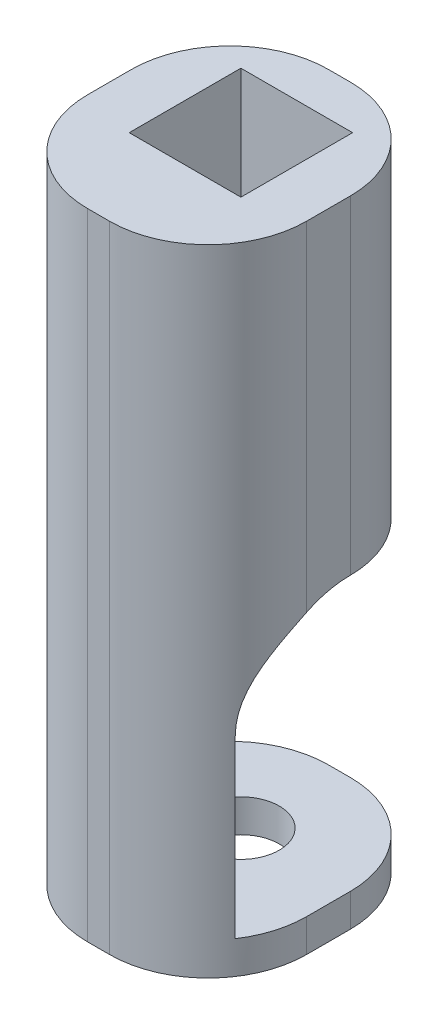
ISO-10303-21;
HEADER;
FILE_DESCRIPTION(('STEP AP214'),'2;1');
FILE_NAME('part.step','',(''),(''),'','','');
FILE_SCHEMA(('AUTOMOTIVE_DESIGN { 1 0 10303 214 1 1 1 1 }'));
ENDSEC;
DATA;
#1=APPLICATION_CONTEXT('core data for automotive mechanical design processes');
#2=APPLICATION_PROTOCOL_DEFINITION('international standard','automotive_design',2000,#1);
#3=PRODUCT_CONTEXT('',#1,'mechanical');
#4=PRODUCT('Part','Part','',(#3));
#5=PRODUCT_RELATED_PRODUCT_CATEGORY('part','',(#4));
#6=PRODUCT_DEFINITION_FORMATION('','',#4);
#7=PRODUCT_DEFINITION_CONTEXT('part definition',#1,'design');
#8=PRODUCT_DEFINITION('design','',#6,#7);
#9=PRODUCT_DEFINITION_SHAPE('','',#8);
#10=(LENGTH_UNIT() NAMED_UNIT(*) SI_UNIT(.MILLI.,.METRE.));
#11=(NAMED_UNIT(*) PLANE_ANGLE_UNIT() SI_UNIT($,.RADIAN.));
#12=(NAMED_UNIT(*) SI_UNIT($,.STERADIAN.) SOLID_ANGLE_UNIT());
#13=UNCERTAINTY_MEASURE_WITH_UNIT(LENGTH_MEASURE(1.E-05),#10,'distance_accuracy_value','');
#14=(GEOMETRIC_REPRESENTATION_CONTEXT(3) GLOBAL_UNCERTAINTY_ASSIGNED_CONTEXT((#13)) GLOBAL_UNIT_ASSIGNED_CONTEXT((#10,
#11,#12)) REPRESENTATION_CONTEXT('',''));
#15=CARTESIAN_POINT('',(0.,0.,0.));
#16=DIRECTION('',(0.,0.,1.));
#17=DIRECTION('',(1.,0.,0.));
#18=AXIS2_PLACEMENT_3D('',#15,#16,#17);
#19=CARTESIAN_POINT('',(-10.,3.,11.));
#20=DIRECTION('',(1.,0.,0.));
#21=DIRECTION('',(0.,0.,-1.));
#22=AXIS2_PLACEMENT_3D('',#19,#20,#21);
#23=PLANE('',#22);
#24=DIRECTION('',(0.,0.,1.));
#25=VECTOR('',#24,1.);
#26=CARTESIAN_POINT('',(-10.,0.,11.));
#27=LINE('',#26,#25);
#28=CARTESIAN_POINT('',(-10.,0.,-2.));
#29=VERTEX_POINT('',#28);
#30=CARTESIAN_POINT('',(-10.,0.,2.));
#31=VERTEX_POINT('',#30);
#32=EDGE_CURVE('E379',#29,#31,#27,.T.);
#33=ORIENTED_EDGE('',*,*,#32,.T.);
#34=DIRECTION('',(0.,-1.,0.));
#35=VECTOR('',#34,1.);
#36=CARTESIAN_POINT('',(-10.,3.,2.));
#37=LINE('',#36,#35);
#38=CARTESIAN_POINT('',(-10.,3.,2.));
#39=VERTEX_POINT('',#38);
#40=EDGE_CURVE('E296',#31,#39,#37,.F.);
#41=ORIENTED_EDGE('',*,*,#40,.T.);
#42=DIRECTION('',(0.,0.,1.));
#43=VECTOR('',#42,1.);
#44=CARTESIAN_POINT('',(-10.,3.,11.));
#45=LINE('',#44,#43);
#46=CARTESIAN_POINT('',(-10.,3.,-2.));
#47=VERTEX_POINT('',#46);
#48=EDGE_CURVE('E375',#47,#39,#45,.T.);
#49=ORIENTED_EDGE('',*,*,#48,.F.);
#50=DIRECTION('',(0.,-1.,0.));
#51=VECTOR('',#50,1.);
#52=CARTESIAN_POINT('',(-10.,3.,-2.));
#53=LINE('',#52,#51);
#54=EDGE_CURVE('E372',#47,#29,#53,.T.);
#55=ORIENTED_EDGE('',*,*,#54,.T.);
#56=EDGE_LOOP('',(#33,#41,#49,#55));
#57=FACE_BOUND('',#56,.T.);
#58=ADVANCED_FACE('F35',(#57),#23,.F.);
#59=CARTESIAN_POINT('',(10.,3.,11.));
#60=DIRECTION('',(-1.,0.,0.));
#61=DIRECTION('',(0.,0.,1.));
#62=AXIS2_PLACEMENT_3D('',#59,#60,#61);
#63=PLANE('',#62);
#64=DIRECTION('',(0.,0.,-1.));
#65=VECTOR('',#64,1.);
#66=CARTESIAN_POINT('',(10.,58.,-11.));
#67=LINE('',#66,#65);
#68=CARTESIAN_POINT('',(10.,58.,1.99999999999999));
#69=VERTEX_POINT('',#68);
#70=CARTESIAN_POINT('',(10.,58.,-2.));
#71=VERTEX_POINT('',#70);
#72=EDGE_CURVE('E319',#69,#71,#67,.T.);
#73=ORIENTED_EDGE('',*,*,#72,.F.);
#74=DIRECTION('',(0.,-1.,0.));
#75=VECTOR('',#74,1.);
#76=CARTESIAN_POINT('',(10.,3.,1.99999999999999));
#77=LINE('',#76,#75);
#78=CARTESIAN_POINT('',(10.,27.0622577482986,1.99999999999999));
#79=VERTEX_POINT('',#78);
#80=EDGE_CURVE('E61',#69,#79,#77,.T.);
#81=ORIENTED_EDGE('',*,*,#80,.T.);
#82=CARTESIAN_POINT('',(10.,19.,-2.));
#83=DIRECTION('',(-1.,0.,0.));
#84=DIRECTION('',(0.,0.,1.));
#85=AXIS2_PLACEMENT_3D('',#82,#83,#84);
#86=CIRCLE('',#85,9.);
#87=CARTESIAN_POINT('',(10.,28.,-2.));
#88=VERTEX_POINT('',#87);
#89=EDGE_CURVE('E48',#79,#88,#86,.T.);
#90=ORIENTED_EDGE('',*,*,#89,.T.);
#91=DIRECTION('',(0.,-1.,0.));
#92=VECTOR('',#91,1.);
#93=CARTESIAN_POINT('',(10.,3.,-2.));
#94=LINE('',#93,#92);
#95=EDGE_CURVE('E361',#88,#71,#94,.F.);
#96=ORIENTED_EDGE('',*,*,#95,.T.);
#97=EDGE_LOOP('',(#73,#81,#90,#96));
#98=FACE_BOUND('',#97,.T.);
#99=ADVANCED_FACE('F263',(#98),#63,.F.);
#100=CARTESIAN_POINT('',(1.,3.,-2.));
#101=DIRECTION('',(0.,1.,0.));
#102=DIRECTION('',(0.,0.,1.));
#103=AXIS2_PLACEMENT_3D('',#100,#101,#102);
#104=PLANE('',#103);
#105=DIRECTION('',(-1.,0.,0.));
#106=VECTOR('',#105,1.);
#107=CARTESIAN_POINT('',(10.,3.,7.));
#108=LINE('',#107,#106);
#109=CARTESIAN_POINT('',(8.48331477354788,3.,7.));
#110=VERTEX_POINT('',#109);
#111=CARTESIAN_POINT('',(-8.48331477354788,3.,7.));
#112=VERTEX_POINT('',#111);
#113=EDGE_CURVE('E336',#110,#112,#108,.T.);
#114=ORIENTED_EDGE('',*,*,#113,.F.);
#115=CARTESIAN_POINT('',(1.,3.,2.));
#116=DIRECTION('',(0.,1.,0.));
#117=DIRECTION('',(0.,0.,1.));
#118=AXIS2_PLACEMENT_3D('',#115,#116,#117);
#119=CIRCLE('',#118,9.);
#120=CARTESIAN_POINT('',(10.,3.,1.99999999999999));
#121=VERTEX_POINT('',#120);
#122=EDGE_CURVE('E345',#110,#121,#119,.T.);
#123=ORIENTED_EDGE('',*,*,#122,.T.);
#124=DIRECTION('',(0.,0.,-1.));
#125=VECTOR('',#124,1.);
#126=CARTESIAN_POINT('',(10.,3.,11.));
#127=LINE('',#126,#125);
#128=CARTESIAN_POINT('',(10.,3.,-2.));
#129=VERTEX_POINT('',#128);
#130=EDGE_CURVE('E378',#121,#129,#127,.T.);
#131=ORIENTED_EDGE('',*,*,#130,.T.);
#132=CARTESIAN_POINT('',(1.,3.,-2.));
#133=DIRECTION('',(0.,1.,0.));
#134=DIRECTION('',(0.,0.,1.));
#135=AXIS2_PLACEMENT_3D('',#132,#133,#134);
#136=CIRCLE('',#135,9.);
#137=CARTESIAN_POINT('',(1.,3.,-11.));
#138=VERTEX_POINT('',#137);
#139=EDGE_CURVE('E396',#129,#138,#136,.T.);
#140=ORIENTED_EDGE('',*,*,#139,.T.);
#141=DIRECTION('',(-1.,0.,0.));
#142=VECTOR('',#141,1.);
#143=CARTESIAN_POINT('',(1.,3.,-11.));
#144=LINE('',#143,#142);
#145=CARTESIAN_POINT('',(-1.,3.,-11.));
#146=VERTEX_POINT('',#145);
#147=EDGE_CURVE('E394',#138,#146,#144,.T.);
#148=ORIENTED_EDGE('',*,*,#147,.T.);
#149=CARTESIAN_POINT('',(-1.,3.,-2.));
#150=DIRECTION('',(0.,1.,0.));
#151=DIRECTION('',(0.,0.,1.));
#152=AXIS2_PLACEMENT_3D('',#149,#150,#151);
#153=CIRCLE('',#152,9.);
#154=EDGE_CURVE('E392',#146,#47,#153,.T.);
#155=ORIENTED_EDGE('',*,*,#154,.T.);
#156=ORIENTED_EDGE('',*,*,#48,.T.);
#157=CARTESIAN_POINT('',(-1.,3.,2.));
#158=DIRECTION('',(0.,1.,0.));
#159=DIRECTION('',(0.,0.,1.));
#160=AXIS2_PLACEMENT_3D('',#157,#158,#159);
#161=CIRCLE('',#160,9.);
#162=EDGE_CURVE('E347',#39,#112,#161,.T.);
#163=ORIENTED_EDGE('',*,*,#162,.T.);
#164=EDGE_LOOP('',(#114,#123,#131,#140,#148,#155,#156,#163));
#165=FACE_BOUND('',#164,.T.);
#166=CARTESIAN_POINT('',(0.,3.,-2.));
#167=DIRECTION('',(0.,1.,0.));
#168=DIRECTION('',(0.,0.,1.));
#169=AXIS2_PLACEMENT_3D('',#166,#167,#168);
#170=CIRCLE('',#169,3.5);
#171=CARTESIAN_POINT('',(0.,3.,1.5));
#172=VERTEX_POINT('',#171);
#173=EDGE_CURVE('E389',#172,#172,#170,.T.);
#174=ORIENTED_EDGE('',*,*,#173,.F.);
#175=EDGE_LOOP('',(#174));
#176=FACE_BOUND('',#175,.T.);
#177=DIRECTION('',(-1.,0.,0.));
#178=VECTOR('',#177,1.);
#179=CARTESIAN_POINT('',(-8.5,3.,-3.5));
#180=LINE('',#179,#178);
#181=CARTESIAN_POINT('',(-6.5,3.,-3.5));
#182=VERTEX_POINT('',#181);
#183=CARTESIAN_POINT('',(-8.5,3.,-3.5));
#184=VERTEX_POINT('',#183);
#185=EDGE_CURVE('E432',#182,#184,#180,.T.);
#186=ORIENTED_EDGE('',*,*,#185,.F.);
#187=DIRECTION('',(0.,0.,-1.));
#188=VECTOR('',#187,1.);
#189=CARTESIAN_POINT('',(-6.5,3.,-0.499999999999999));
#190=LINE('',#189,#188);
#191=CARTESIAN_POINT('',(-6.5,3.,-0.499999999999999));
#192=VERTEX_POINT('',#191);
#193=EDGE_CURVE('E418',#192,#182,#190,.T.);
#194=ORIENTED_EDGE('',*,*,#193,.F.);
#195=DIRECTION('',(1.,0.,0.));
#196=VECTOR('',#195,1.);
#197=CARTESIAN_POINT('',(-8.5,3.,-0.499999999999999));
#198=LINE('',#197,#196);
#199=CARTESIAN_POINT('',(-8.5,3.,-0.499999999999999));
#200=VERTEX_POINT('',#199);
#201=EDGE_CURVE('E414',#200,#192,#198,.T.);
#202=ORIENTED_EDGE('',*,*,#201,.F.);
#203=DIRECTION('',(0.,0.,1.));
#204=VECTOR('',#203,1.);
#205=CARTESIAN_POINT('',(-8.5,3.,-0.499999999999999));
#206=LINE('',#205,#204);
#207=EDGE_CURVE('E429',#184,#200,#206,.T.);
#208=ORIENTED_EDGE('',*,*,#207,.F.);
#209=EDGE_LOOP('',(#186,#194,#202,#208));
#210=FACE_BOUND('',#209,.T.);
#211=ADVANCED_FACE('F270',(#165,#176,#210),#104,.T.);
#212=CARTESIAN_POINT('',(1.,0.,-2.));
#213=DIRECTION('',(0.,1.,0.));
#214=DIRECTION('',(0.,0.,1.));
#215=AXIS2_PLACEMENT_3D('',#212,#213,#214);
#216=PLANE('',#215);
#217=CARTESIAN_POINT('',(0.,0.,-2.));
#218=DIRECTION('',(0.,1.,0.));
#219=DIRECTION('',(0.,0.,1.));
#220=AXIS2_PLACEMENT_3D('',#217,#218,#219);
#221=CIRCLE('',#220,3.5);
#222=CARTESIAN_POINT('',(0.,0.,1.5));
#223=VERTEX_POINT('',#222);
#224=EDGE_CURVE('E399',#223,#223,#221,.T.);
#225=ORIENTED_EDGE('',*,*,#224,.T.);
#226=EDGE_LOOP('',(#225));
#227=FACE_BOUND('',#226,.T.);
#228=DIRECTION('',(0.,0.,-1.));
#229=VECTOR('',#228,1.);
#230=CARTESIAN_POINT('',(10.,0.,11.));
#231=LINE('',#230,#229);
#232=CARTESIAN_POINT('',(10.,0.,1.99999999999999));
#233=VERTEX_POINT('',#232);
#234=CARTESIAN_POINT('',(10.,0.,-2.));
#235=VERTEX_POINT('',#234);
#236=EDGE_CURVE('E387',#233,#235,#231,.T.);
#237=ORIENTED_EDGE('',*,*,#236,.F.);
#238=CARTESIAN_POINT('',(1.,0.,2.));
#239=DIRECTION('',(0.,1.,0.));
#240=DIRECTION('',(0.,0.,1.));
#241=AXIS2_PLACEMENT_3D('',#238,#239,#240);
#242=CIRCLE('',#241,9.);
#243=CARTESIAN_POINT('',(1.,0.,11.));
#244=VERTEX_POINT('',#243);
#245=EDGE_CURVE('E341',#233,#244,#242,.F.);
#246=ORIENTED_EDGE('',*,*,#245,.T.);
#247=DIRECTION('',(1.,0.,0.));
#248=VECTOR('',#247,1.);
#249=CARTESIAN_POINT('',(10.,0.,11.));
#250=LINE('',#249,#248);
#251=CARTESIAN_POINT('',(-1.,0.,11.));
#252=VERTEX_POINT('',#251);
#253=EDGE_CURVE('E376',#252,#244,#250,.T.);
#254=ORIENTED_EDGE('',*,*,#253,.F.);
#255=CARTESIAN_POINT('',(-1.,0.,2.));
#256=DIRECTION('',(0.,1.,0.));
#257=DIRECTION('',(0.,0.,1.));
#258=AXIS2_PLACEMENT_3D('',#255,#256,#257);
#259=CIRCLE('',#258,9.);
#260=EDGE_CURVE('E340',#252,#31,#259,.F.);
#261=ORIENTED_EDGE('',*,*,#260,.T.);
#262=ORIENTED_EDGE('',*,*,#32,.F.);
#263=CARTESIAN_POINT('',(-1.,0.,-2.));
#264=DIRECTION('',(0.,1.,0.));
#265=DIRECTION('',(0.,0.,1.));
#266=AXIS2_PLACEMENT_3D('',#263,#264,#265);
#267=CIRCLE('',#266,9.);
#268=CARTESIAN_POINT('',(-1.,0.,-11.));
#269=VERTEX_POINT('',#268);
#270=EDGE_CURVE('E381',#269,#29,#267,.T.);
#271=ORIENTED_EDGE('',*,*,#270,.F.);
#272=DIRECTION('',(-1.,0.,0.));
#273=VECTOR('',#272,1.);
#274=CARTESIAN_POINT('',(1.,0.,-11.));
#275=LINE('',#274,#273);
#276=CARTESIAN_POINT('',(1.,0.,-11.));
#277=VERTEX_POINT('',#276);
#278=EDGE_CURVE('E383',#277,#269,#275,.T.);
#279=ORIENTED_EDGE('',*,*,#278,.F.);
#280=CARTESIAN_POINT('',(1.,0.,-2.));
#281=DIRECTION('',(0.,1.,0.));
#282=DIRECTION('',(0.,0.,1.));
#283=AXIS2_PLACEMENT_3D('',#280,#281,#282);
#284=CIRCLE('',#283,9.);
#285=EDGE_CURVE('E385',#235,#277,#284,.T.);
#286=ORIENTED_EDGE('',*,*,#285,.F.);
#287=EDGE_LOOP('',(#237,#246,#254,#261,#262,#271,#279,#286));
#288=FACE_BOUND('',#287,.T.);
#289=DIRECTION('',(0.,0.,-1.));
#290=VECTOR('',#289,1.);
#291=CARTESIAN_POINT('',(-6.5,0.,-0.499999999999999));
#292=LINE('',#291,#290);
#293=CARTESIAN_POINT('',(-6.5,0.,-0.499999999999999));
#294=VERTEX_POINT('',#293);
#295=CARTESIAN_POINT('',(-6.5,0.,-3.5));
#296=VERTEX_POINT('',#295);
#297=EDGE_CURVE('E425',#294,#296,#292,.T.);
#298=ORIENTED_EDGE('',*,*,#297,.T.);
#299=DIRECTION('',(-1.,0.,0.));
#300=VECTOR('',#299,1.);
#301=CARTESIAN_POINT('',(-8.5,0.,-3.5));
#302=LINE('',#301,#300);
#303=CARTESIAN_POINT('',(-8.5,0.,-3.5));
#304=VERTEX_POINT('',#303);
#305=EDGE_CURVE('E422',#296,#304,#302,.T.);
#306=ORIENTED_EDGE('',*,*,#305,.T.);
#307=DIRECTION('',(0.,0.,1.));
#308=VECTOR('',#307,1.);
#309=CARTESIAN_POINT('',(-8.5,0.,-0.499999999999999));
#310=LINE('',#309,#308);
#311=CARTESIAN_POINT('',(-8.5,0.,-0.499999999999999));
#312=VERTEX_POINT('',#311);
#313=EDGE_CURVE('E419',#304,#312,#310,.T.);
#314=ORIENTED_EDGE('',*,*,#313,.T.);
#315=DIRECTION('',(1.,0.,0.));
#316=VECTOR('',#315,1.);
#317=CARTESIAN_POINT('',(-8.5,0.,-0.499999999999999));
#318=LINE('',#317,#316);
#319=EDGE_CURVE('E415',#312,#294,#318,.T.);
#320=ORIENTED_EDGE('',*,*,#319,.T.);
#321=EDGE_LOOP('',(#298,#306,#314,#320));
#322=FACE_BOUND('',#321,.T.);
#323=ADVANCED_FACE('F533',(#227,#288,#322),#216,.F.);
#324=ORIENTED_EDGE('',*,*,#130,.F.);
#325=DIRECTION('',(0.,-1.,0.));
#326=VECTOR('',#325,1.);
#327=CARTESIAN_POINT('',(10.,3.,1.99999999999999));
#328=LINE('',#327,#326);
#329=EDGE_CURVE('E359',#121,#233,#328,.T.);
#330=ORIENTED_EDGE('',*,*,#329,.T.);
#331=ORIENTED_EDGE('',*,*,#236,.T.);
#332=DIRECTION('',(0.,-1.,0.));
#333=VECTOR('',#332,1.);
#334=CARTESIAN_POINT('',(10.,3.,-2.));
#335=LINE('',#334,#333);
#336=EDGE_CURVE('E363',#129,#235,#335,.T.);
#337=ORIENTED_EDGE('',*,*,#336,.F.);
#338=EDGE_LOOP('',(#324,#330,#331,#337));
#339=FACE_BOUND('',#338,.T.);
#340=ADVANCED_FACE('F271',(#339),#63,.F.);
#341=CARTESIAN_POINT('',(1.,3.,-2.));
#342=DIRECTION('',(0.,-1.,0.));
#343=DIRECTION('',(0.,0.,-1.));
#344=AXIS2_PLACEMENT_3D('',#341,#342,#343);
#345=CYLINDRICAL_SURFACE('',#344,9.);
#346=ORIENTED_EDGE('',*,*,#285,.T.);
#347=DIRECTION('',(0.,-1.,0.));
#348=VECTOR('',#347,1.);
#349=CARTESIAN_POINT('',(1.,3.,-11.));
#350=LINE('',#349,#348);
#351=EDGE_CURVE('E366',#138,#277,#350,.T.);
#352=ORIENTED_EDGE('',*,*,#351,.F.);
#353=ORIENTED_EDGE('',*,*,#139,.F.);
#354=ORIENTED_EDGE('',*,*,#336,.T.);
#355=EDGE_LOOP('',(#346,#352,#353,#354));
#356=FACE_BOUND('',#355,.T.);
#357=ADVANCED_FACE('F540',(#356),#345,.T.);
#358=CARTESIAN_POINT('',(1.,3.,-11.));
#359=DIRECTION('',(0.,0.,1.));
#360=DIRECTION('',(1.,0.,0.));
#361=AXIS2_PLACEMENT_3D('',#358,#359,#360);
#362=PLANE('',#361);
#363=ORIENTED_EDGE('',*,*,#278,.T.);
#364=DIRECTION('',(0.,-1.,0.));
#365=VECTOR('',#364,1.);
#366=CARTESIAN_POINT('',(-1.,3.,-11.));
#367=LINE('',#366,#365);
#368=EDGE_CURVE('E369',#146,#269,#367,.T.);
#369=ORIENTED_EDGE('',*,*,#368,.F.);
#370=ORIENTED_EDGE('',*,*,#147,.F.);
#371=ORIENTED_EDGE('',*,*,#351,.T.);
#372=EDGE_LOOP('',(#363,#369,#370,#371));
#373=FACE_BOUND('',#372,.T.);
#374=ADVANCED_FACE('F285',(#373),#362,.F.);
#375=CARTESIAN_POINT('',(-1.,3.,-2.));
#376=DIRECTION('',(0.,-1.,0.));
#377=DIRECTION('',(0.,0.,-1.));
#378=AXIS2_PLACEMENT_3D('',#375,#376,#377);
#379=CYLINDRICAL_SURFACE('',#378,9.);
#380=ORIENTED_EDGE('',*,*,#270,.T.);
#381=ORIENTED_EDGE('',*,*,#54,.F.);
#382=ORIENTED_EDGE('',*,*,#154,.F.);
#383=ORIENTED_EDGE('',*,*,#368,.T.);
#384=EDGE_LOOP('',(#380,#381,#382,#383));
#385=FACE_BOUND('',#384,.T.);
#386=ADVANCED_FACE('F277',(#385),#379,.T.);
#387=DIRECTION('',(0.,-1.,0.));
#388=VECTOR('',#387,1.);
#389=CARTESIAN_POINT('',(-10.,3.,-2.));
#390=LINE('',#389,#388);
#391=CARTESIAN_POINT('',(-10.,58.,-2.));
#392=VERTEX_POINT('',#391);
#393=CARTESIAN_POINT('',(-10.,28.,-2.));
#394=VERTEX_POINT('',#393);
#395=EDGE_CURVE('E290',#392,#394,#390,.T.);
#396=ORIENTED_EDGE('',*,*,#395,.T.);
#397=CARTESIAN_POINT('',(-10.,19.,-2.));
#398=DIRECTION('',(1.,0.,0.));
#399=DIRECTION('',(0.,0.,-1.));
#400=AXIS2_PLACEMENT_3D('',#397,#398,#399);
#401=CIRCLE('',#400,9.);
#402=CARTESIAN_POINT('',(-10.,27.0622577482985,2.));
#403=VERTEX_POINT('',#402);
#404=EDGE_CURVE('E220',#394,#403,#401,.T.);
#405=ORIENTED_EDGE('',*,*,#404,.T.);
#406=DIRECTION('',(0.,-1.,0.));
#407=VECTOR('',#406,1.);
#408=CARTESIAN_POINT('',(-10.,3.,2.));
#409=LINE('',#408,#407);
#410=CARTESIAN_POINT('',(-10.,58.,2.));
#411=VERTEX_POINT('',#410);
#412=EDGE_CURVE('E293',#403,#411,#409,.F.);
#413=ORIENTED_EDGE('',*,*,#412,.T.);
#414=DIRECTION('',(0.,0.,1.));
#415=VECTOR('',#414,1.);
#416=CARTESIAN_POINT('',(-10.,58.,-11.));
#417=LINE('',#416,#415);
#418=EDGE_CURVE('E292',#392,#411,#417,.T.);
#419=ORIENTED_EDGE('',*,*,#418,.F.);
#420=EDGE_LOOP('',(#396,#405,#413,#419));
#421=FACE_BOUND('',#420,.T.);
#422=ADVANCED_FACE('F266',(#421),#23,.F.);
#423=CARTESIAN_POINT('',(10.,3.,11.));
#424=DIRECTION('',(0.,0.,-1.));
#425=DIRECTION('',(-1.,0.,0.));
#426=AXIS2_PLACEMENT_3D('',#423,#424,#425);
#427=PLANE('',#426);
#428=ORIENTED_EDGE('',*,*,#253,.T.);
#429=DIRECTION('',(0.,-1.,0.));
#430=VECTOR('',#429,1.);
#431=CARTESIAN_POINT('',(1.,3.,11.));
#432=LINE('',#431,#430);
#433=CARTESIAN_POINT('',(1.,58.,11.));
#434=VERTEX_POINT('',#433);
#435=EDGE_CURVE('E321',#244,#434,#432,.F.);
#436=ORIENTED_EDGE('',*,*,#435,.T.);
#437=DIRECTION('',(1.,0.,0.));
#438=VECTOR('',#437,1.);
#439=CARTESIAN_POINT('',(-10.,58.,11.));
#440=LINE('',#439,#438);
#441=CARTESIAN_POINT('',(-1.,58.,11.));
#442=VERTEX_POINT('',#441);
#443=EDGE_CURVE('E329',#442,#434,#440,.T.);
#444=ORIENTED_EDGE('',*,*,#443,.F.);
#445=DIRECTION('',(0.,-1.,0.));
#446=VECTOR('',#445,1.);
#447=CARTESIAN_POINT('',(-1.,3.,11.));
#448=LINE('',#447,#446);
#449=EDGE_CURVE('E324',#442,#252,#448,.T.);
#450=ORIENTED_EDGE('',*,*,#449,.T.);
#451=EDGE_LOOP('',(#428,#436,#444,#450));
#452=FACE_BOUND('',#451,.T.);
#453=ADVANCED_FACE('F276',(#452),#427,.F.);
#454=CARTESIAN_POINT('',(0.,3.,-2.));
#455=DIRECTION('',(0.,-1.,0.));
#456=DIRECTION('',(0.,0.,-1.));
#457=AXIS2_PLACEMENT_3D('',#454,#455,#456);
#458=CYLINDRICAL_SURFACE('',#457,3.5);
#459=ORIENTED_EDGE('',*,*,#173,.T.);
#460=EDGE_LOOP('',(#459));
#461=FACE_BOUND('',#460,.T.);
#462=ORIENTED_EDGE('',*,*,#224,.F.);
#463=EDGE_LOOP('',(#462));
#464=FACE_BOUND('',#463,.T.);
#465=ADVANCED_FACE('F283',(#461,#464),#458,.F.);
#466=CARTESIAN_POINT('',(-6.5,3.,-0.499999999999999));
#467=DIRECTION('',(-1.,0.,0.));
#468=DIRECTION('',(0.,0.,1.));
#469=AXIS2_PLACEMENT_3D('',#466,#467,#468);
#470=PLANE('',#469);
#471=ORIENTED_EDGE('',*,*,#297,.F.);
#472=DIRECTION('',(0.,-1.,0.));
#473=VECTOR('',#472,1.);
#474=CARTESIAN_POINT('',(-6.5,3.,-0.499999999999999));
#475=LINE('',#474,#473);
#476=EDGE_CURVE('E411',#192,#294,#475,.T.);
#477=ORIENTED_EDGE('',*,*,#476,.F.);
#478=ORIENTED_EDGE('',*,*,#193,.T.);
#479=DIRECTION('',(0.,-1.,0.));
#480=VECTOR('',#479,1.);
#481=CARTESIAN_POINT('',(-6.5,3.,-3.5));
#482=LINE('',#481,#480);
#483=EDGE_CURVE('E402',#182,#296,#482,.T.);
#484=ORIENTED_EDGE('',*,*,#483,.T.);
#485=EDGE_LOOP('',(#471,#477,#478,#484));
#486=FACE_BOUND('',#485,.T.);
#487=ADVANCED_FACE('F523',(#486),#470,.T.);
#488=CARTESIAN_POINT('',(-8.5,3.,-3.5));
#489=DIRECTION('',(0.,0.,1.));
#490=DIRECTION('',(1.,0.,0.));
#491=AXIS2_PLACEMENT_3D('',#488,#489,#490);
#492=PLANE('',#491);
#493=ORIENTED_EDGE('',*,*,#305,.F.);
#494=ORIENTED_EDGE('',*,*,#483,.F.);
#495=ORIENTED_EDGE('',*,*,#185,.T.);
#496=DIRECTION('',(0.,-1.,0.));
#497=VECTOR('',#496,1.);
#498=CARTESIAN_POINT('',(-8.5,3.,-3.5));
#499=LINE('',#498,#497);
#500=EDGE_CURVE('E407',#184,#304,#499,.T.);
#501=ORIENTED_EDGE('',*,*,#500,.T.);
#502=EDGE_LOOP('',(#493,#494,#495,#501));
#503=FACE_BOUND('',#502,.T.);
#504=ADVANCED_FACE('F519',(#503),#492,.T.);
#505=CARTESIAN_POINT('',(-8.5,3.,-0.499999999999999));
#506=DIRECTION('',(1.,0.,0.));
#507=DIRECTION('',(0.,0.,-1.));
#508=AXIS2_PLACEMENT_3D('',#505,#506,#507);
#509=PLANE('',#508);
#510=ORIENTED_EDGE('',*,*,#313,.F.);
#511=ORIENTED_EDGE('',*,*,#500,.F.);
#512=ORIENTED_EDGE('',*,*,#207,.T.);
#513=DIRECTION('',(0.,-1.,0.));
#514=VECTOR('',#513,1.);
#515=CARTESIAN_POINT('',(-8.5,3.,-0.499999999999999));
#516=LINE('',#515,#514);
#517=EDGE_CURVE('E409',#200,#312,#516,.T.);
#518=ORIENTED_EDGE('',*,*,#517,.T.);
#519=EDGE_LOOP('',(#510,#511,#512,#518));
#520=FACE_BOUND('',#519,.T.);
#521=ADVANCED_FACE('F515',(#520),#509,.T.);
#522=CARTESIAN_POINT('',(-8.5,3.,-0.499999999999999));
#523=DIRECTION('',(0.,0.,-1.));
#524=DIRECTION('',(-1.,0.,0.));
#525=AXIS2_PLACEMENT_3D('',#522,#523,#524);
#526=PLANE('',#525);
#527=ORIENTED_EDGE('',*,*,#319,.F.);
#528=ORIENTED_EDGE('',*,*,#517,.F.);
#529=ORIENTED_EDGE('',*,*,#201,.T.);
#530=ORIENTED_EDGE('',*,*,#476,.T.);
#531=EDGE_LOOP('',(#527,#528,#529,#530));
#532=FACE_BOUND('',#531,.T.);
#533=ADVANCED_FACE('F511',(#532),#526,.T.);
#534=CARTESIAN_POINT('',(10.,28.,7.));
#535=DIRECTION('',(0.,0.,1.));
#536=DIRECTION('',(1.,0.,0.));
#537=AXIS2_PLACEMENT_3D('',#534,#535,#536);
#538=PLANE('',#537);
#539=DIRECTION('',(0.,-1.,0.));
#540=VECTOR('',#539,1.);
#541=CARTESIAN_POINT('',(-8.48331477354788,3.,7.));
#542=LINE('',#541,#540);
#543=CARTESIAN_POINT('',(-8.48331477354788,19.,7.));
#544=VERTEX_POINT('',#543);
#545=EDGE_CURVE('E351',#112,#544,#542,.F.);
#546=ORIENTED_EDGE('',*,*,#545,.T.);
#547=DIRECTION('',(-1.,0.,0.));
#548=VECTOR('',#547,1.);
#549=CARTESIAN_POINT('',(8.48331477354788,19.,7.));
#550=LINE('',#549,#548);
#551=CARTESIAN_POINT('',(8.48331477354788,19.,7.));
#552=VERTEX_POINT('',#551);
#553=EDGE_CURVE('E224',#544,#552,#550,.F.);
#554=ORIENTED_EDGE('',*,*,#553,.T.);
#555=DIRECTION('',(0.,-1.,0.));
#556=VECTOR('',#555,1.);
#557=CARTESIAN_POINT('',(8.48331477354788,28.,7.));
#558=LINE('',#557,#556);
#559=EDGE_CURVE('E349',#552,#110,#558,.T.);
#560=ORIENTED_EDGE('',*,*,#559,.T.);
#561=ORIENTED_EDGE('',*,*,#113,.T.);
#562=EDGE_LOOP('',(#546,#554,#560,#561));
#563=FACE_BOUND('',#562,.T.);
#564=ADVANCED_FACE('F507',(#563),#538,.F.);
#565=CARTESIAN_POINT('',(0.,28.,0.));
#566=DIRECTION('',(0.,1.,0.));
#567=DIRECTION('',(0.,0.,1.));
#568=AXIS2_PLACEMENT_3D('',#565,#566,#567);
#569=PLANE('',#568);
#570=DIRECTION('',(-1.,0.,0.));
#571=VECTOR('',#570,1.);
#572=CARTESIAN_POINT('',(-8.48331477354788,28.,-2.));
#573=LINE('',#572,#571);
#574=CARTESIAN_POINT('',(4.,28.,-2.));
#575=VERTEX_POINT('',#574);
#576=EDGE_CURVE('E214',#88,#575,#573,.T.);
#577=ORIENTED_EDGE('',*,*,#576,.T.);
#578=CARTESIAN_POINT('',(0.,28.,-2.));
#579=DIRECTION('',(0.,1.,0.));
#580=DIRECTION('',(0.,0.,1.));
#581=AXIS2_PLACEMENT_3D('',#578,#579,#580);
#582=CIRCLE('',#581,4.);
#583=CARTESIAN_POINT('',(-4.,28.,-2.));
#584=VERTEX_POINT('',#583);
#585=EDGE_CURVE('E54',#575,#584,#582,.T.);
#586=ORIENTED_EDGE('',*,*,#585,.T.);
#587=EDGE_CURVE('E211',#584,#394,#573,.T.);
#588=ORIENTED_EDGE('',*,*,#587,.T.);
#589=CARTESIAN_POINT('',(-1.,28.,-2.));
#590=DIRECTION('',(0.,1.,0.));
#591=DIRECTION('',(0.,0.,1.));
#592=AXIS2_PLACEMENT_3D('',#589,#590,#591);
#593=CIRCLE('',#592,9.);
#594=CARTESIAN_POINT('',(-1.,28.,-11.));
#595=VERTEX_POINT('',#594);
#596=EDGE_CURVE('E356',#394,#595,#593,.F.);
#597=ORIENTED_EDGE('',*,*,#596,.T.);
#598=DIRECTION('',(-1.,0.,0.));
#599=VECTOR('',#598,1.);
#600=CARTESIAN_POINT('',(-10.,28.,-11.));
#601=LINE('',#600,#599);
#602=CARTESIAN_POINT('',(0.999999999999999,28.,-11.));
#603=VERTEX_POINT('',#602);
#604=EDGE_CURVE('E311',#603,#595,#601,.T.);
#605=ORIENTED_EDGE('',*,*,#604,.F.);
#606=CARTESIAN_POINT('',(0.999999999999999,28.,-2.));
#607=DIRECTION('',(0.,1.,0.));
#608=DIRECTION('',(0.,0.,1.));
#609=AXIS2_PLACEMENT_3D('',#606,#607,#608);
#610=CIRCLE('',#609,9.);
#611=EDGE_CURVE('E354',#603,#88,#610,.F.);
#612=ORIENTED_EDGE('',*,*,#611,.T.);
#613=EDGE_LOOP('',(#577,#586,#588,#597,#605,#612));
#614=FACE_BOUND('',#613,.T.);
#615=ADVANCED_FACE('F210',(#614),#569,.F.);
#616=CARTESIAN_POINT('',(-10.,58.,-11.));
#617=DIRECTION('',(0.,0.,1.));
#618=DIRECTION('',(1.,0.,0.));
#619=AXIS2_PLACEMENT_3D('',#616,#617,#618);
#620=PLANE('',#619);
#621=DIRECTION('',(-1.,0.,0.));
#622=VECTOR('',#621,1.);
#623=CARTESIAN_POINT('',(-10.,58.,-11.));
#624=LINE('',#623,#622);
#625=CARTESIAN_POINT('',(0.999999999999999,58.,-11.));
#626=VERTEX_POINT('',#625);
#627=CARTESIAN_POINT('',(-1.,58.,-11.));
#628=VERTEX_POINT('',#627);
#629=EDGE_CURVE('E308',#626,#628,#624,.T.);
#630=ORIENTED_EDGE('',*,*,#629,.F.);
#631=DIRECTION('',(0.,-1.,0.));
#632=VECTOR('',#631,1.);
#633=CARTESIAN_POINT('',(0.999999999999999,58.,-11.));
#634=LINE('',#633,#632);
#635=EDGE_CURVE('E222',#626,#603,#634,.T.);
#636=ORIENTED_EDGE('',*,*,#635,.T.);
#637=ORIENTED_EDGE('',*,*,#604,.T.);
#638=DIRECTION('',(0.,-1.,0.));
#639=VECTOR('',#638,1.);
#640=CARTESIAN_POINT('',(-1.,58.,-11.));
#641=LINE('',#640,#639);
#642=EDGE_CURVE('E226',#595,#628,#641,.F.);
#643=ORIENTED_EDGE('',*,*,#642,.T.);
#644=EDGE_LOOP('',(#630,#636,#637,#643));
#645=FACE_BOUND('',#644,.T.);
#646=ADVANCED_FACE('F307',(#645),#620,.F.);
#647=CARTESIAN_POINT('',(0.,58.,0.));
#648=DIRECTION('',(0.,1.,0.));
#649=DIRECTION('',(0.,0.,1.));
#650=AXIS2_PLACEMENT_3D('',#647,#648,#649);
#651=PLANE('',#650);
#652=DIRECTION('',(0.,0.,-1.));
#653=VECTOR('',#652,1.);
#654=CARTESIAN_POINT('',(5.1,58.,3.1));
#655=LINE('',#654,#653);
#656=CARTESIAN_POINT('',(5.1,58.,3.1));
#657=VERTEX_POINT('',#656);
#658=CARTESIAN_POINT('',(5.1,58.,-7.1));
#659=VERTEX_POINT('',#658);
#660=EDGE_CURVE('E215',#657,#659,#655,.T.);
#661=ORIENTED_EDGE('',*,*,#660,.F.);
#662=DIRECTION('',(1.,0.,0.));
#663=VECTOR('',#662,1.);
#664=CARTESIAN_POINT('',(-5.1,58.,3.1));
#665=LINE('',#664,#663);
#666=CARTESIAN_POINT('',(-5.1,58.,3.1));
#667=VERTEX_POINT('',#666);
#668=EDGE_CURVE('E450',#667,#657,#665,.T.);
#669=ORIENTED_EDGE('',*,*,#668,.F.);
#670=DIRECTION('',(0.,0.,1.));
#671=VECTOR('',#670,1.);
#672=CARTESIAN_POINT('',(-5.1,58.,3.1));
#673=LINE('',#672,#671);
#674=CARTESIAN_POINT('',(-5.1,58.,-7.1));
#675=VERTEX_POINT('',#674);
#676=EDGE_CURVE('E454',#675,#667,#673,.T.);
#677=ORIENTED_EDGE('',*,*,#676,.F.);
#678=DIRECTION('',(-1.,0.,0.));
#679=VECTOR('',#678,1.);
#680=CARTESIAN_POINT('',(-5.1,58.,-7.1));
#681=LINE('',#680,#679);
#682=EDGE_CURVE('E457',#659,#675,#681,.T.);
#683=ORIENTED_EDGE('',*,*,#682,.F.);
#684=EDGE_LOOP('',(#661,#669,#677,#683));
#685=FACE_BOUND('',#684,.T.);
#686=ORIENTED_EDGE('',*,*,#443,.T.);
#687=CARTESIAN_POINT('',(1.,58.,2.));
#688=DIRECTION('',(0.,1.,0.));
#689=DIRECTION('',(0.,0.,1.));
#690=AXIS2_PLACEMENT_3D('',#687,#688,#689);
#691=CIRCLE('',#690,9.);
#692=EDGE_CURVE('E294',#434,#69,#691,.T.);
#693=ORIENTED_EDGE('',*,*,#692,.T.);
#694=ORIENTED_EDGE('',*,*,#72,.T.);
#695=CARTESIAN_POINT('',(0.999999999999999,58.,-2.));
#696=DIRECTION('',(0.,1.,0.));
#697=DIRECTION('',(0.,0.,1.));
#698=AXIS2_PLACEMENT_3D('',#695,#696,#697);
#699=CIRCLE('',#698,9.);
#700=EDGE_CURVE('E318',#71,#626,#699,.T.);
#701=ORIENTED_EDGE('',*,*,#700,.T.);
#702=ORIENTED_EDGE('',*,*,#629,.T.);
#703=CARTESIAN_POINT('',(-1.,58.,-2.));
#704=DIRECTION('',(0.,1.,0.));
#705=DIRECTION('',(0.,0.,1.));
#706=AXIS2_PLACEMENT_3D('',#703,#704,#705);
#707=CIRCLE('',#706,9.);
#708=EDGE_CURVE('E315',#628,#392,#707,.T.);
#709=ORIENTED_EDGE('',*,*,#708,.T.);
#710=ORIENTED_EDGE('',*,*,#418,.T.);
#711=CARTESIAN_POINT('',(-1.,58.,2.));
#712=DIRECTION('',(0.,1.,0.));
#713=DIRECTION('',(0.,0.,1.));
#714=AXIS2_PLACEMENT_3D('',#711,#712,#713);
#715=CIRCLE('',#714,9.);
#716=EDGE_CURVE('E298',#411,#442,#715,.T.);
#717=ORIENTED_EDGE('',*,*,#716,.T.);
#718=EDGE_LOOP('',(#686,#693,#694,#701,#702,#709,#710,#717));
#719=FACE_BOUND('',#718,.T.);
#720=ADVANCED_FACE('F314',(#685,#719),#651,.T.);
#721=CARTESIAN_POINT('',(5.1,33.,3.1));
#722=DIRECTION('',(1.,0.,0.));
#723=DIRECTION('',(0.,0.,-1.));
#724=AXIS2_PLACEMENT_3D('',#721,#722,#723);
#725=PLANE('',#724);
#726=ORIENTED_EDGE('',*,*,#660,.T.);
#727=DIRECTION('',(0.,1.,0.));
#728=VECTOR('',#727,1.);
#729=CARTESIAN_POINT('',(5.1,33.,-7.1));
#730=LINE('',#729,#728);
#731=CARTESIAN_POINT('',(5.1,33.,-7.1));
#732=VERTEX_POINT('',#731);
#733=EDGE_CURVE('E441',#732,#659,#730,.T.);
#734=ORIENTED_EDGE('',*,*,#733,.F.);
#735=DIRECTION('',(0.,0.,-1.));
#736=VECTOR('',#735,1.);
#737=CARTESIAN_POINT('',(5.1,33.,3.1));
#738=LINE('',#737,#736);
#739=CARTESIAN_POINT('',(5.1,33.,3.1));
#740=VERTEX_POINT('',#739);
#741=EDGE_CURVE('E453',#740,#732,#738,.T.);
#742=ORIENTED_EDGE('',*,*,#741,.F.);
#743=DIRECTION('',(0.,1.,0.));
#744=VECTOR('',#743,1.);
#745=CARTESIAN_POINT('',(5.1,33.,3.1));
#746=LINE('',#745,#744);
#747=EDGE_CURVE('E437',#740,#657,#746,.T.);
#748=ORIENTED_EDGE('',*,*,#747,.T.);
#749=EDGE_LOOP('',(#726,#734,#742,#748));
#750=FACE_BOUND('',#749,.T.);
#751=ADVANCED_FACE('F484',(#750),#725,.F.);
#752=CARTESIAN_POINT('',(-5.1,33.,3.1));
#753=DIRECTION('',(0.,0.,1.));
#754=DIRECTION('',(1.,0.,0.));
#755=AXIS2_PLACEMENT_3D('',#752,#753,#754);
#756=PLANE('',#755);
#757=ORIENTED_EDGE('',*,*,#668,.T.);
#758=ORIENTED_EDGE('',*,*,#747,.F.);
#759=DIRECTION('',(1.,0.,0.));
#760=VECTOR('',#759,1.);
#761=CARTESIAN_POINT('',(-5.1,33.,3.1));
#762=LINE('',#761,#760);
#763=CARTESIAN_POINT('',(-5.1,33.,3.1));
#764=VERTEX_POINT('',#763);
#765=EDGE_CURVE('E445',#764,#740,#762,.T.);
#766=ORIENTED_EDGE('',*,*,#765,.F.);
#767=DIRECTION('',(0.,1.,0.));
#768=VECTOR('',#767,1.);
#769=CARTESIAN_POINT('',(-5.1,33.,3.1));
#770=LINE('',#769,#768);
#771=EDGE_CURVE('E447',#764,#667,#770,.T.);
#772=ORIENTED_EDGE('',*,*,#771,.T.);
#773=EDGE_LOOP('',(#757,#758,#766,#772));
#774=FACE_BOUND('',#773,.T.);
#775=ADVANCED_FACE('F493',(#774),#756,.F.);
#776=CARTESIAN_POINT('',(-5.1,33.,3.1));
#777=DIRECTION('',(-1.,0.,0.));
#778=DIRECTION('',(0.,0.,1.));
#779=AXIS2_PLACEMENT_3D('',#776,#777,#778);
#780=PLANE('',#779);
#781=ORIENTED_EDGE('',*,*,#676,.T.);
#782=ORIENTED_EDGE('',*,*,#771,.F.);
#783=DIRECTION('',(0.,0.,1.));
#784=VECTOR('',#783,1.);
#785=CARTESIAN_POINT('',(-5.1,33.,3.1));
#786=LINE('',#785,#784);
#787=CARTESIAN_POINT('',(-5.1,33.,-7.1));
#788=VERTEX_POINT('',#787);
#789=EDGE_CURVE('E463',#788,#764,#786,.T.);
#790=ORIENTED_EDGE('',*,*,#789,.F.);
#791=DIRECTION('',(0.,1.,0.));
#792=VECTOR('',#791,1.);
#793=CARTESIAN_POINT('',(-5.1,33.,-7.1));
#794=LINE('',#793,#792);
#795=EDGE_CURVE('E444',#788,#675,#794,.T.);
#796=ORIENTED_EDGE('',*,*,#795,.T.);
#797=EDGE_LOOP('',(#781,#782,#790,#796));
#798=FACE_BOUND('',#797,.T.);
#799=ADVANCED_FACE('F491',(#798),#780,.F.);
#800=CARTESIAN_POINT('',(-5.1,33.,-7.1));
#801=DIRECTION('',(0.,0.,-1.));
#802=DIRECTION('',(-1.,0.,0.));
#803=AXIS2_PLACEMENT_3D('',#800,#801,#802);
#804=PLANE('',#803);
#805=ORIENTED_EDGE('',*,*,#682,.T.);
#806=ORIENTED_EDGE('',*,*,#795,.F.);
#807=DIRECTION('',(-1.,0.,0.));
#808=VECTOR('',#807,1.);
#809=CARTESIAN_POINT('',(-5.1,33.,-7.1));
#810=LINE('',#809,#808);
#811=EDGE_CURVE('E466',#732,#788,#810,.T.);
#812=ORIENTED_EDGE('',*,*,#811,.F.);
#813=ORIENTED_EDGE('',*,*,#733,.T.);
#814=EDGE_LOOP('',(#805,#806,#812,#813));
#815=FACE_BOUND('',#814,.T.);
#816=ADVANCED_FACE('F478',(#815),#804,.F.);
#817=CARTESIAN_POINT('',(0.,33.,0.));
#818=DIRECTION('',(0.,-1.,0.));
#819=DIRECTION('',(0.,0.,-1.));
#820=AXIS2_PLACEMENT_3D('',#817,#818,#819);
#821=PLANE('',#820);
#822=CARTESIAN_POINT('',(0.,33.,-2.));
#823=DIRECTION('',(0.,1.,0.));
#824=DIRECTION('',(0.,0.,1.));
#825=AXIS2_PLACEMENT_3D('',#822,#823,#824);
#826=CIRCLE('',#825,4.);
#827=CARTESIAN_POINT('',(0.,33.,2.));
#828=VERTEX_POINT('',#827);
#829=EDGE_CURVE('E216',#828,#828,#826,.T.);
#830=ORIENTED_EDGE('',*,*,#829,.F.);
#831=EDGE_LOOP('',(#830));
#832=FACE_BOUND('',#831,.T.);
#833=ORIENTED_EDGE('',*,*,#741,.T.);
#834=ORIENTED_EDGE('',*,*,#811,.T.);
#835=ORIENTED_EDGE('',*,*,#789,.T.);
#836=ORIENTED_EDGE('',*,*,#765,.T.);
#837=EDGE_LOOP('',(#833,#834,#835,#836));
#838=FACE_BOUND('',#837,.T.);
#839=ADVANCED_FACE('F475',(#832,#838),#821,.F.);
#840=CARTESIAN_POINT('',(1.,3.,2.));
#841=DIRECTION('',(0.,-1.,0.));
#842=DIRECTION('',(0.,0.,-1.));
#843=AXIS2_PLACEMENT_3D('',#840,#841,#842);
#844=CYLINDRICAL_SURFACE('',#843,9.);
#845=ORIENTED_EDGE('',*,*,#692,.F.);
#846=ORIENTED_EDGE('',*,*,#435,.F.);
#847=ORIENTED_EDGE('',*,*,#245,.F.);
#848=ORIENTED_EDGE('',*,*,#329,.F.);
#849=ORIENTED_EDGE('',*,*,#122,.F.);
#850=ORIENTED_EDGE('',*,*,#559,.F.);
#851=CARTESIAN_POINT('',(8.48331477354788,19.,7.));
#852=CARTESIAN_POINT('',(8.4833088080825,19.1184326755693,7.00000129439137));
#853=CARTESIAN_POINT('',(8.48487767736836,19.2368469800018,6.99766173943068));
#854=CARTESIAN_POINT('',(8.49110854986301,19.4734004773092,6.98832026182902));
#855=CARTESIAN_POINT('',(8.49577029724096,19.5915396921273,6.98131872480888));
#856=CARTESIAN_POINT('',(8.51429413575369,19.9449051442493,6.95337418101642));
#857=CARTESIAN_POINT('',(8.53269511609102,20.1793932665003,6.92549112762579));
#858=CARTESIAN_POINT('',(8.5802720326039,20.6424549160615,6.85194332537051));
#859=CARTESIAN_POINT('',(8.60936107189643,20.871060658575,6.80642182346709));
#860=CARTESIAN_POINT('',(8.67665963925631,21.3228281365835,6.69818604931231));
#861=CARTESIAN_POINT('',(8.71487132999055,21.5459885673347,6.63546769975553));
#862=CARTESIAN_POINT('',(8.79824110962418,21.9847019948788,6.49378981048735));
#863=CARTESIAN_POINT('',(8.84337004864661,22.2002824525514,6.41489797697289));
#864=CARTESIAN_POINT('',(8.938539367338,22.6237958405873,6.24139078871157));
#865=CARTESIAN_POINT('',(8.98857957062494,22.8317290452238,6.14677599855082));
#866=CARTESIAN_POINT('',(9.1431941126745,23.4444137164779,5.83940141595524));
#867=CARTESIAN_POINT('',(9.25201965648605,23.8368837984368,5.60349070205461));
#868=CARTESIAN_POINT('',(9.41654429451014,24.4170292028031,5.19171149717876));
#869=CARTESIAN_POINT('',(9.47443233464542,24.6184425057983,5.03550425757134));
#870=CARTESIAN_POINT('',(9.58540682797802,25.008173561368,4.70574018381788));
#871=CARTESIAN_POINT('',(9.63849221646757,25.1964884079954,4.5321795204284));
#872=CARTESIAN_POINT('',(9.73670696674223,25.5579755984273,4.1691451605026));
#873=CARTESIAN_POINT('',(9.78186394951638,25.7311994088525,3.97973024683587));
#874=CARTESIAN_POINT('',(9.86151603926074,26.0617174122045,3.58553869172202));
#875=CARTESIAN_POINT('',(9.89601835200992,26.2190223225045,3.38077254933401));
#876=CARTESIAN_POINT('',(9.9479782901841,26.4973259653395,2.98408095876965));
#877=CARTESIAN_POINT('',(9.96704333996897,26.6203987463795,2.79382380903815));
#878=CARTESIAN_POINT('',(9.99307628690108,26.8523271914527,2.40371676886044));
#879=CARTESIAN_POINT('',(10.0000279800695,26.9611636319821,2.20385439600455));
#880=CARTESIAN_POINT('',(10.,27.0622577482986,1.99999999999999));
#881=B_SPLINE_CURVE_WITH_KNOTS('',3,(#851,#852,#853,#854,#855,#856,#857,#858,#859,#860,#861,
#862,#863,#864,#865,#866,#867,#868,#869,#870,#871,#872,#873,#874,#875,#876,#877,#878,#879,#880),
.UNSPECIFIED.,.F.,.F.,(4,2,2,2,2,2,2,2,2,2,2,2,2,2,4),(0.,0.355228593379744,0.710427807295931,
1.41988780415793,2.12370291483667,2.82768504184126,3.52877819429726,4.22984617706266,
5.63569668113667,6.419107409511,7.20269139008765,7.98348888088717,8.76375715412732,
9.44500323312035,10.1271599141244),.UNSPECIFIED.);
#882=EDGE_CURVE('E238',#552,#79,#881,.T.);
#883=ORIENTED_EDGE('',*,*,#882,.T.);
#884=ORIENTED_EDGE('',*,*,#80,.F.);
#885=EDGE_LOOP('',(#845,#846,#847,#848,#849,#850,#883,#884));
#886=FACE_BOUND('',#885,.T.);
#887=ADVANCED_FACE('F248',(#886),#844,.T.);
#888=CARTESIAN_POINT('',(-1.,3.,2.));
#889=DIRECTION('',(0.,-1.,0.));
#890=DIRECTION('',(0.,0.,-1.));
#891=AXIS2_PLACEMENT_3D('',#888,#889,#890);
#892=CYLINDRICAL_SURFACE('',#891,9.);
#893=ORIENTED_EDGE('',*,*,#162,.F.);
#894=ORIENTED_EDGE('',*,*,#40,.F.);
#895=ORIENTED_EDGE('',*,*,#260,.F.);
#896=ORIENTED_EDGE('',*,*,#449,.F.);
#897=ORIENTED_EDGE('',*,*,#716,.F.);
#898=ORIENTED_EDGE('',*,*,#412,.F.);
#899=CARTESIAN_POINT('',(-10.,27.0622577482985,2.));
#900=CARTESIAN_POINT('',(-10.000001298089,27.0096696069639,2.1059986983297));
#901=CARTESIAN_POINT('',(-9.99812708486876,26.9549984385254,2.21093648023049));
#902=CARTESIAN_POINT('',(-9.99086545365993,26.84162820351,2.41846597496849));
#903=CARTESIAN_POINT('',(-9.98547866497675,26.7829298601183,2.52105810464051));
#904=CARTESIAN_POINT('',(-9.96442722271575,26.601164009955,2.82471514453375));
#905=CARTESIAN_POINT('',(-9.94386997626699,26.472258246272,3.02199780813308));
#906=CARTESIAN_POINT('',(-9.89198157534686,26.2012465297748,3.40336838307687));
#907=CARTESIAN_POINT('',(-9.86073473193183,26.0592500435324,3.58754631900884));
#908=CARTESIAN_POINT('',(-9.78953639592384,25.7623324668893,3.94344916777847));
#909=CARTESIAN_POINT('',(-9.74958200233803,25.6074070797578,4.11516990492272));
#910=CARTESIAN_POINT('',(-9.66332636070631,25.2865682989914,4.4445036747928));
#911=CARTESIAN_POINT('',(-9.61705903332742,25.1207159278897,4.60218512648111));
#912=CARTESIAN_POINT('',(-9.52014025533122,24.7783205791358,4.90384797713637));
#913=CARTESIAN_POINT('',(-9.46948918373469,24.6017785261147,5.04783055825949));
#914=CARTESIAN_POINT('',(-9.31370262275976,24.0559871267107,5.45955224801484));
#915=CARTESIAN_POINT('',(-9.20497660729385,23.6714044149136,5.70621453079385));
#916=CARTESIAN_POINT('',(-9.04138101030544,23.0445831594638,6.04406730977768));
#917=CARTESIAN_POINT('',(-8.98380167759647,22.8138761241014,6.15600309448027));
#918=CARTESIAN_POINT('',(-8.8741179592827,22.3425012148132,6.36023931581105));
#919=CARTESIAN_POINT('',(-8.82201469691487,22.1018313113868,6.45253572802596));
#920=CARTESIAN_POINT('',(-8.72652228157559,21.6127397647932,6.61625679224829));
#921=CARTESIAN_POINT('',(-8.68310417381426,21.3643471801196,6.68775116968127));
#922=CARTESIAN_POINT('',(-8.60759237980998,20.8608228539466,6.80933253762103));
#923=CARTESIAN_POINT('',(-8.57549098049672,20.6056958303748,6.85943411364673));
#924=CARTESIAN_POINT('',(-8.5283379403458,20.1259942462749,6.9321128931528));
#925=CARTESIAN_POINT('',(-8.51155315946493,19.9020216875544,6.95752030221779));
#926=CARTESIAN_POINT('',(-8.49466461786754,19.5646367111005,6.98298045270273));
#927=CARTESIAN_POINT('',(-8.49041648741448,19.45187120223,6.98935869781537));
#928=CARTESIAN_POINT('',(-8.48473851028812,19.2260753102173,6.99786978600425));
#929=CARTESIAN_POINT('',(-8.48330951635354,19.1130448572818,7.00000134453516));
#930=CARTESIAN_POINT('',(-8.48331477354788,19.,7.));
#931=B_SPLINE_CURVE_WITH_KNOTS('',3,(#899,#900,#901,#902,#903,#904,#905,#906,#907,#908,#909,
#910,#911,#912,#913,#914,#915,#916,#917,#918,#919,#920,#921,#922,#923,#924,#925,#926,#927,#928,
#929,#930),.UNSPECIFIED.,.F.,.F.,(4,2,2,2,2,2,2,2,2,2,2,2,2,2,2,4),(0.,0.354897797362481,
0.709732029467755,1.41827614406113,2.12135596410532,2.82467038010071,3.52434455187639,
4.22395828978141,5.62679417670174,6.41447935325498,7.20232578365989,7.98750021463481,
8.7721384589823,9.44929701477889,9.78827177636694,10.1273490560869),.UNSPECIFIED.);
#932=EDGE_CURVE('E232',#403,#544,#931,.T.);
#933=ORIENTED_EDGE('',*,*,#932,.T.);
#934=ORIENTED_EDGE('',*,*,#545,.F.);
#935=EDGE_LOOP('',(#893,#894,#895,#896,#897,#898,#933,#934));
#936=FACE_BOUND('',#935,.T.);
#937=ADVANCED_FACE('F243',(#936),#892,.T.);
#938=CARTESIAN_POINT('',(0.999999999999999,58.,-2.));
#939=DIRECTION('',(0.,-1.,0.));
#940=DIRECTION('',(0.,0.,-1.));
#941=AXIS2_PLACEMENT_3D('',#938,#939,#940);
#942=CYLINDRICAL_SURFACE('',#941,9.);
#943=ORIENTED_EDGE('',*,*,#700,.F.);
#944=ORIENTED_EDGE('',*,*,#95,.F.);
#945=ORIENTED_EDGE('',*,*,#611,.F.);
#946=ORIENTED_EDGE('',*,*,#635,.F.);
#947=EDGE_LOOP('',(#943,#944,#945,#946));
#948=FACE_BOUND('',#947,.T.);
#949=ADVANCED_FACE('F247',(#948),#942,.T.);
#950=CARTESIAN_POINT('',(-1.,3.,-2.));
#951=DIRECTION('',(0.,-1.,0.));
#952=DIRECTION('',(0.,0.,-1.));
#953=AXIS2_PLACEMENT_3D('',#950,#951,#952);
#954=CYLINDRICAL_SURFACE('',#953,9.);
#955=ORIENTED_EDGE('',*,*,#708,.F.);
#956=ORIENTED_EDGE('',*,*,#642,.F.);
#957=ORIENTED_EDGE('',*,*,#596,.F.);
#958=ORIENTED_EDGE('',*,*,#395,.F.);
#959=EDGE_LOOP('',(#955,#956,#957,#958));
#960=FACE_BOUND('',#959,.T.);
#961=ADVANCED_FACE('F253',(#960),#954,.T.);
#962=CARTESIAN_POINT('',(0.,19.,-2.));
#963=DIRECTION('',(1.,0.,0.));
#964=DIRECTION('',(0.,0.,-1.));
#965=AXIS2_PLACEMENT_3D('',#962,#963,#964);
#966=CYLINDRICAL_SURFACE('',#965,9.);
#967=ORIENTED_EDGE('',*,*,#587,.F.);
#968=CARTESIAN_POINT('',(-4.,28.,-2.));
#969=CARTESIAN_POINT('',(-4.00001595356455,28.000017369987,-1.89304202566351));
#970=CARTESIAN_POINT('',(-3.99571040672147,27.9980937756938,-1.78609498232747));
#971=CARTESIAN_POINT('',(-3.97858025330883,27.9904945948358,-1.57305519630512));
#972=CARTESIAN_POINT('',(-3.9657585665734,27.9848202942371,-1.46696217342424));
#973=CARTESIAN_POINT('',(-3.93178655807411,27.9698787815183,-1.25680072392967));
#974=CARTESIAN_POINT('',(-3.91066904381814,27.9606257245084,-1.15272599651275));
#975=CARTESIAN_POINT('',(-3.86034801474481,27.9387794646401,-0.946933540022801));
#976=CARTESIAN_POINT('',(-3.83114409748445,27.9261860955427,-0.845215928531511));
#977=CARTESIAN_POINT('',(-3.73186305312669,27.8838706824963,-0.544821411984916));
#978=CARTESIAN_POINT('',(-3.65005351708187,27.8495843167192,-0.35051857009913));
#979=CARTESIAN_POINT('',(-3.45796224345374,27.7721036869579,0.0215010221686185));
#980=CARTESIAN_POINT('',(-3.34765623032649,27.7289018344035,0.199203454408257));
#981=CARTESIAN_POINT('',(-3.09532248406582,27.6351974338656,0.542961729567348));
#982=CARTESIAN_POINT('',(-2.95197860078193,27.5844370182354,0.707982672884128));
#983=CARTESIAN_POINT('',(-2.64049563810592,27.4823660827153,1.0125270917976));
#984=CARTESIAN_POINT('',(-2.47234456435293,27.4310553079161,1.15203815979874));
#985=CARTESIAN_POINT('',(-2.10407698869698,27.3303155823518,1.40970784280126));
#986=CARTESIAN_POINT('',(-1.90267456570621,27.2811668752362,1.52616594700172));
#987=CARTESIAN_POINT('',(-1.58643584436153,27.2162079094052,1.67380102484911));
#988=CARTESIAN_POINT('',(-1.47862571403227,27.1960099096322,1.71851526272538));
#989=CARTESIAN_POINT('',(-1.25897846502943,27.1592484684675,1.79850032767303));
#990=CARTESIAN_POINT('',(-1.14714354930531,27.1426830729735,1.83377623420513));
#991=CARTESIAN_POINT('',(-0.926211169579742,27.1145850250345,1.89288131977442));
#992=CARTESIAN_POINT('',(-0.817274953399553,27.1028350195537,1.91721138419377));
#993=CARTESIAN_POINT('',(-0.597426479269436,27.0836216693321,1.95670885055623));
#994=CARTESIAN_POINT('',(-0.486515199617813,27.076156260046,1.97188066561144));
#995=CARTESIAN_POINT('',(-0.263633846223006,27.0657991230264,1.99287145923361));
#996=CARTESIAN_POINT('',(-0.151664131306587,27.0629058975031,1.99869350067867));
#997=CARTESIAN_POINT('',(0.0723866790565148,27.0618044849887,2.00091368252823));
#998=CARTESIAN_POINT('',(0.184467766885798,27.0635959970337,1.99731242831804));
#999=CARTESIAN_POINT('',(0.397728171014115,27.0714234212315,1.98148129909725));
#1000=CARTESIAN_POINT('',(0.498982439031848,27.0770636400025,1.97005551686274));
#1001=CARTESIAN_POINT('',(0.700074954767328,27.0919727759409,1.93957540857483));
#1002=CARTESIAN_POINT('',(0.799912734180875,27.1012428654846,1.92051861781156));
#1003=CARTESIAN_POINT('',(1.09624143632117,27.1340870832504,1.85217547399304));
#1004=CARTESIAN_POINT('',(1.28971996820275,27.1627022286113,1.79170319997476));
#1005=CARTESIAN_POINT('',(1.66789640343475,27.2308169278605,1.64150134683506));
#1006=CARTESIAN_POINT('',(1.85229972067842,27.2705463856703,1.55114549942217));
#1007=CARTESIAN_POINT('',(2.20414135652867,27.3563809971687,1.34416347029754));
#1008=CARTESIAN_POINT('',(2.37157216685448,27.4024889514266,1.22752573492741));
#1009=CARTESIAN_POINT('',(2.70181786678118,27.5013291098024,0.958030845556789));
#1010=CARTESIAN_POINT('',(2.86259636731761,27.5542692005895,0.802753006640909));
#1011=CARTESIAN_POINT('',(3.15664004260883,27.6570993369174,0.466857319272578));
#1012=CARTESIAN_POINT('',(3.28989451613943,27.706988190864,0.286229660584881));
#1013=CARTESIAN_POINT('',(3.46798039644623,27.7763203544196,-0.00337206949611728));
#1014=CARTESIAN_POINT('',(3.52437779512872,27.7988058968653,-0.104674943572517));
#1015=CARTESIAN_POINT('',(3.62835450418237,27.8409667589984,-0.312250863735153));
#1016=CARTESIAN_POINT('',(3.67593764754343,27.860643299358,-0.418521724131965));
#1017=CARTESIAN_POINT('',(3.76176151727357,27.8965909692227,-0.63518719259808));
#1018=CARTESIAN_POINT('',(3.80001262963207,27.9128658816169,-0.745577057183566));
#1019=CARTESIAN_POINT('',(3.86680161152167,27.9415464750538,-0.969699898469683));
#1020=CARTESIAN_POINT('',(3.89534342532231,27.9539537271088,-1.08343149718938));
#1021=CARTESIAN_POINT('',(3.94574249434416,27.9759823961333,-1.32985901699943));
#1022=CARTESIAN_POINT('',(3.96605267812411,27.9849485110966,-1.46293423954311));
#1023=CARTESIAN_POINT('',(3.99320128130862,27.9969791809454,-1.73066861721947));
#1024=CARTESIAN_POINT('',(4.00004395448203,28.0000455992675,-1.86532725869979));
#1025=CARTESIAN_POINT('',(4.,28.,-2.));
#1026=B_SPLINE_CURVE_WITH_KNOTS('',3,(#968,#969,#970,#971,#972,#973,#974,#975,#976,#977,#978,
#979,#980,#981,#982,#983,#984,#985,#986,#987,#988,#989,#990,#991,#992,#993,#994,#995,#996,#997,
#998,#999,#1000,#1001,#1002,#1003,#1004,#1005,#1006,#1007,#1008,#1009,#1010,#1011,#1012,#1013,
#1014,#1015,#1016,#1017,#1018,#1019,#1020,#1021,#1022,#1023,#1024,#1025),.UNSPECIFIED.,.F.,.F.,
(4,2,2,2,2,2,2,2,2,2,2,2,2,2,2,2,2,2,2,2,2,2,2,2,2,2,2,2,4),(0.,0.320751720261166,
0.641393524677251,0.960779849779884,1.28018207291519,1.91782984562163,2.55602261849287,
3.22630509501993,3.89691272403228,4.60628603397455,4.96122843715663,5.31597943372146,
5.65223584271535,5.98833008924418,6.32431421269537,6.66027675188724,6.96606253960081,
7.27194717164629,7.88320418973976,8.50818208481515,9.13343526138659,9.81956159979019,
10.5059542011288,10.8598773949198,11.2136463175782,11.5670197019694,11.9202493613539,
12.3241697829275,12.7279626040803),.UNSPECIFIED.);
#1027=EDGE_CURVE('E11',#584,#575,#1026,.T.);
#1028=ORIENTED_EDGE('',*,*,#1027,.T.);
#1029=ORIENTED_EDGE('',*,*,#576,.F.);
#1030=ORIENTED_EDGE('',*,*,#89,.F.);
#1031=ORIENTED_EDGE('',*,*,#882,.F.);
#1032=ORIENTED_EDGE('',*,*,#553,.F.);
#1033=ORIENTED_EDGE('',*,*,#932,.F.);
#1034=ORIENTED_EDGE('',*,*,#404,.F.);
#1035=EDGE_LOOP('',(#967,#1028,#1029,#1030,#1031,#1032,#1033,#1034));
#1036=FACE_BOUND('',#1035,.T.);
#1037=ADVANCED_FACE('F37',(#1036),#966,.F.);
#1038=CARTESIAN_POINT('',(0.,23.,-2.));
#1039=DIRECTION('',(0.,1.,0.));
#1040=DIRECTION('',(0.,0.,1.));
#1041=AXIS2_PLACEMENT_3D('',#1038,#1039,#1040);
#1042=CYLINDRICAL_SURFACE('',#1041,4.);
#1043=ORIENTED_EDGE('',*,*,#829,.T.);
#1044=EDGE_LOOP('',(#1043));
#1045=FACE_BOUND('',#1044,.T.);
#1046=ORIENTED_EDGE('',*,*,#1027,.F.);
#1047=ORIENTED_EDGE('',*,*,#585,.F.);
#1048=EDGE_LOOP('',(#1046,#1047));
#1049=FACE_BOUND('',#1048,.T.);
#1050=ADVANCED_FACE('F204',(#1045,#1049),#1042,.F.);
#1051=CLOSED_SHELL('',(#58,#99,#211,#323,#340,#357,#374,#386,#422,#453,#465,#487,#504,#521,#533,
#564,#615,#646,#720,#751,#775,#799,#816,#839,#887,#937,#949,#961,#1037,#1050));
#1052=MANIFOLD_SOLID_BREP('B2',#1051);
#1053=ADVANCED_BREP_SHAPE_REPRESENTATION('',(#18,#1052),#14);
#1054=SHAPE_DEFINITION_REPRESENTATION(#9,#1053);
ENDSEC;
END-ISO-10303-21;
